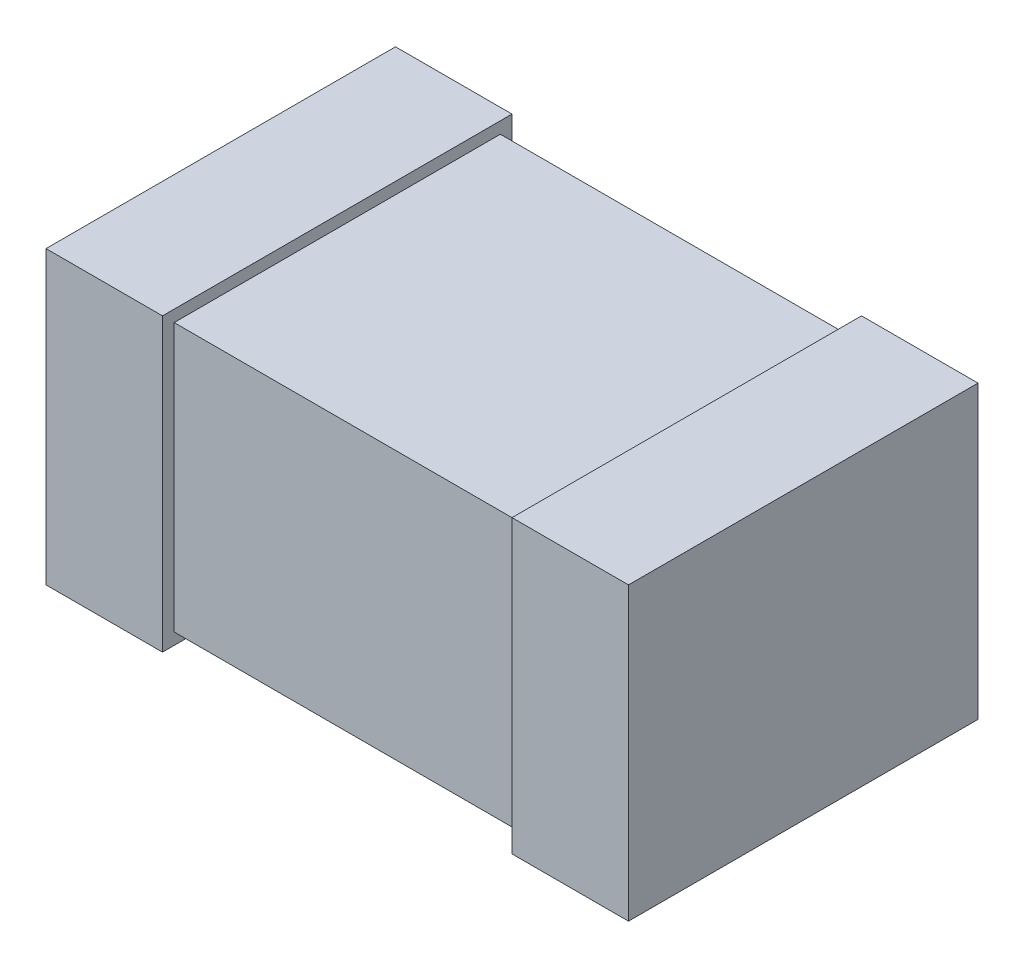
ISO-10303-21;
HEADER;
FILE_DESCRIPTION(('STEP AP214'),'2;1');
FILE_NAME('part.step','',(''),(''),'','','');
FILE_SCHEMA(('AUTOMOTIVE_DESIGN { 1 0 10303 214 1 1 1 1 }'));
ENDSEC;
DATA;
#1=APPLICATION_CONTEXT('core data for automotive mechanical design processes');
#2=APPLICATION_PROTOCOL_DEFINITION('international standard','automotive_design',2000,#1);
#3=PRODUCT_CONTEXT('',#1,'mechanical');
#4=PRODUCT('Part','Part','',(#3));
#5=PRODUCT_RELATED_PRODUCT_CATEGORY('part','',(#4));
#6=PRODUCT_DEFINITION_FORMATION('','',#4);
#7=PRODUCT_DEFINITION_CONTEXT('part definition',#1,'design');
#8=PRODUCT_DEFINITION('design','',#6,#7);
#9=PRODUCT_DEFINITION_SHAPE('','',#8);
#10=(LENGTH_UNIT() NAMED_UNIT(*) SI_UNIT(.MILLI.,.METRE.));
#11=(NAMED_UNIT(*) PLANE_ANGLE_UNIT() SI_UNIT($,.RADIAN.));
#12=(NAMED_UNIT(*) SI_UNIT($,.STERADIAN.) SOLID_ANGLE_UNIT());
#13=UNCERTAINTY_MEASURE_WITH_UNIT(LENGTH_MEASURE(1.E-05),#10,'distance_accuracy_value','');
#14=(GEOMETRIC_REPRESENTATION_CONTEXT(3) GLOBAL_UNCERTAINTY_ASSIGNED_CONTEXT((#13)) GLOBAL_UNIT_ASSIGNED_CONTEXT((#10,
#11,#12)) REPRESENTATION_CONTEXT('',''));
#15=CARTESIAN_POINT('',(0.,0.,0.));
#16=DIRECTION('',(0.,0.,1.));
#17=DIRECTION('',(1.,0.,0.));
#18=AXIS2_PLACEMENT_3D('',#15,#16,#17);
#19=CARTESIAN_POINT('',(0.5,-0.25,0.0762));
#20=DIRECTION('',(1.,0.,0.));
#21=DIRECTION('',(0.,1.,0.));
#22=AXIS2_PLACEMENT_3D('',#19,#20,#21);
#23=PLANE('',#22);
#24=DIRECTION('',(0.,0.,1.));
#25=VECTOR('',#24,1.);
#26=CARTESIAN_POINT('',(0.5,0.25,0.0762));
#27=LINE('',#26,#25);
#28=CARTESIAN_POINT('',(0.5,0.25,0.0762));
#29=VERTEX_POINT('',#28);
#30=CARTESIAN_POINT('',(0.5,0.25,0.6762));
#31=VERTEX_POINT('',#30);
#32=EDGE_CURVE('E174',#29,#31,#27,.T.);
#33=ORIENTED_EDGE('',*,*,#32,.T.);
#34=DIRECTION('',(0.,1.,0.));
#35=VECTOR('',#34,1.);
#36=CARTESIAN_POINT('',(0.5,-0.25,0.6762));
#37=LINE('',#36,#35);
#38=CARTESIAN_POINT('',(0.5,-0.25,0.6762));
#39=VERTEX_POINT('',#38);
#40=EDGE_CURVE('E157',#39,#31,#37,.T.);
#41=ORIENTED_EDGE('',*,*,#40,.F.);
#42=DIRECTION('',(0.,0.,1.));
#43=VECTOR('',#42,1.);
#44=CARTESIAN_POINT('',(0.5,-0.25,0.0762));
#45=LINE('',#44,#43);
#46=CARTESIAN_POINT('',(0.5,-0.25,0.0762));
#47=VERTEX_POINT('',#46);
#48=EDGE_CURVE('E154',#47,#39,#45,.T.);
#49=ORIENTED_EDGE('',*,*,#48,.F.);
#50=DIRECTION('',(0.,1.,0.));
#51=VECTOR('',#50,1.);
#52=CARTESIAN_POINT('',(0.5,-0.25,0.0762));
#53=LINE('',#52,#51);
#54=EDGE_CURVE('E143',#47,#29,#53,.T.);
#55=ORIENTED_EDGE('',*,*,#54,.T.);
#56=EDGE_LOOP('',(#33,#41,#49,#55));
#57=FACE_BOUND('',#56,.T.);
#58=ADVANCED_FACE('F17',(#57),#23,.T.);
#59=CARTESIAN_POINT('',(0.3,-0.23,0.0762));
#60=DIRECTION('',(0.,1.,0.));
#61=DIRECTION('',(1.,0.,0.));
#62=AXIS2_PLACEMENT_3D('',#59,#60,#61);
#63=PLANE('',#62);
#64=DIRECTION('',(0.,0.,-1.));
#65=VECTOR('',#64,1.);
#66=CARTESIAN_POINT('',(-0.3,-0.23,0.6562));
#67=LINE('',#66,#65);
#68=CARTESIAN_POINT('',(-0.3,-0.23,0.6562));
#69=VERTEX_POINT('',#68);
#70=CARTESIAN_POINT('',(-0.3,-0.23,0.0962));
#71=VERTEX_POINT('',#70);
#72=EDGE_CURVE('E235',#69,#71,#67,.T.);
#73=ORIENTED_EDGE('',*,*,#72,.T.);
#74=DIRECTION('',(-1.,0.,0.));
#75=VECTOR('',#74,1.);
#76=CARTESIAN_POINT('',(0.3,-0.23,0.0962));
#77=LINE('',#76,#75);
#78=CARTESIAN_POINT('',(0.3,-0.23,0.0962));
#79=VERTEX_POINT('',#78);
#80=EDGE_CURVE('E21',#79,#71,#77,.T.);
#81=ORIENTED_EDGE('',*,*,#80,.F.);
#82=DIRECTION('',(0.,0.,-1.));
#83=VECTOR('',#82,1.);
#84=CARTESIAN_POINT('',(0.3,-0.23,0.6562));
#85=LINE('',#84,#83);
#86=CARTESIAN_POINT('',(0.3,-0.23,0.6562));
#87=VERTEX_POINT('',#86);
#88=EDGE_CURVE('E166',#87,#79,#85,.T.);
#89=ORIENTED_EDGE('',*,*,#88,.F.);
#90=DIRECTION('',(-1.,0.,0.));
#91=VECTOR('',#90,1.);
#92=CARTESIAN_POINT('',(0.3,-0.23,0.6562));
#93=LINE('',#92,#91);
#94=EDGE_CURVE('E11',#87,#69,#93,.T.);
#95=ORIENTED_EDGE('',*,*,#94,.T.);
#96=EDGE_LOOP('',(#73,#81,#89,#95));
#97=FACE_BOUND('',#96,.T.);
#98=ADVANCED_FACE('F302',(#97),#63,.F.);
#99=CARTESIAN_POINT('',(0.3,0.25,0.6562));
#100=DIRECTION('',(0.,0.,-1.));
#101=DIRECTION('',(0.,-1.,0.));
#102=AXIS2_PLACEMENT_3D('',#99,#100,#101);
#103=PLANE('',#102);
#104=DIRECTION('',(0.,-1.,0.));
#105=VECTOR('',#104,1.);
#106=CARTESIAN_POINT('',(-0.3,0.23,0.6562));
#107=LINE('',#106,#105);
#108=CARTESIAN_POINT('',(-0.3,0.23,0.6562));
#109=VERTEX_POINT('',#108);
#110=EDGE_CURVE('E225',#109,#69,#107,.T.);
#111=ORIENTED_EDGE('',*,*,#110,.T.);
#112=ORIENTED_EDGE('',*,*,#94,.F.);
#113=DIRECTION('',(0.,-1.,0.));
#114=VECTOR('',#113,1.);
#115=CARTESIAN_POINT('',(0.3,0.23,0.6562));
#116=LINE('',#115,#114);
#117=CARTESIAN_POINT('',(0.3,0.23,0.6562));
#118=VERTEX_POINT('',#117);
#119=EDGE_CURVE('E171',#118,#87,#116,.T.);
#120=ORIENTED_EDGE('',*,*,#119,.F.);
#121=DIRECTION('',(1.,0.,0.));
#122=VECTOR('',#121,1.);
#123=CARTESIAN_POINT('',(-0.3,0.23,0.6562));
#124=LINE('',#123,#122);
#125=EDGE_CURVE('E28',#109,#118,#124,.T.);
#126=ORIENTED_EDGE('',*,*,#125,.F.);
#127=EDGE_LOOP('',(#111,#112,#120,#126));
#128=FACE_BOUND('',#127,.T.);
#129=ADVANCED_FACE('F308',(#128),#103,.F.);
#130=CARTESIAN_POINT('',(-0.3,0.23,0.0762));
#131=DIRECTION('',(0.,-1.,0.));
#132=DIRECTION('',(0.,0.,-1.));
#133=AXIS2_PLACEMENT_3D('',#130,#131,#132);
#134=PLANE('',#133);
#135=DIRECTION('',(0.,0.,-1.));
#136=VECTOR('',#135,1.);
#137=CARTESIAN_POINT('',(0.3,0.23,0.6562));
#138=LINE('',#137,#136);
#139=CARTESIAN_POINT('',(0.3,0.23,0.0962));
#140=VERTEX_POINT('',#139);
#141=EDGE_CURVE('E201',#118,#140,#138,.T.);
#142=ORIENTED_EDGE('',*,*,#141,.T.);
#143=DIRECTION('',(1.,0.,0.));
#144=VECTOR('',#143,1.);
#145=CARTESIAN_POINT('',(-0.3,0.23,0.0962));
#146=LINE('',#145,#144);
#147=CARTESIAN_POINT('',(-0.3,0.23,0.0962));
#148=VERTEX_POINT('',#147);
#149=EDGE_CURVE('E257',#148,#140,#146,.T.);
#150=ORIENTED_EDGE('',*,*,#149,.F.);
#151=DIRECTION('',(0.,0.,-1.));
#152=VECTOR('',#151,1.);
#153=CARTESIAN_POINT('',(-0.3,0.23,0.6562));
#154=LINE('',#153,#152);
#155=EDGE_CURVE('E270',#109,#148,#154,.T.);
#156=ORIENTED_EDGE('',*,*,#155,.F.);
#157=ORIENTED_EDGE('',*,*,#125,.T.);
#158=EDGE_LOOP('',(#142,#150,#156,#157));
#159=FACE_BOUND('',#158,.T.);
#160=ADVANCED_FACE('F326',(#159),#134,.F.);
#161=CARTESIAN_POINT('',(-0.3,0.25,0.0962));
#162=DIRECTION('',(0.,0.,1.));
#163=DIRECTION('',(1.,0.,0.));
#164=AXIS2_PLACEMENT_3D('',#161,#162,#163);
#165=PLANE('',#164);
#166=DIRECTION('',(0.,-1.,0.));
#167=VECTOR('',#166,1.);
#168=CARTESIAN_POINT('',(0.3,0.23,0.0962));
#169=LINE('',#168,#167);
#170=EDGE_CURVE('E170',#140,#79,#169,.T.);
#171=ORIENTED_EDGE('',*,*,#170,.T.);
#172=ORIENTED_EDGE('',*,*,#80,.T.);
#173=DIRECTION('',(0.,-1.,0.));
#174=VECTOR('',#173,1.);
#175=CARTESIAN_POINT('',(-0.3,0.23,0.0962));
#176=LINE('',#175,#174);
#177=EDGE_CURVE('E267',#148,#71,#176,.T.);
#178=ORIENTED_EDGE('',*,*,#177,.F.);
#179=ORIENTED_EDGE('',*,*,#149,.T.);
#180=EDGE_LOOP('',(#171,#172,#178,#179));
#181=FACE_BOUND('',#180,.T.);
#182=ADVANCED_FACE('F329',(#181),#165,.F.);
#183=CARTESIAN_POINT('',(0.3,0.23,0.0762));
#184=DIRECTION('',(1.,0.,0.));
#185=DIRECTION('',(0.,1.,0.));
#186=AXIS2_PLACEMENT_3D('',#183,#184,#185);
#187=PLANE('',#186);
#188=ORIENTED_EDGE('',*,*,#141,.F.);
#189=ORIENTED_EDGE('',*,*,#119,.T.);
#190=ORIENTED_EDGE('',*,*,#88,.T.);
#191=ORIENTED_EDGE('',*,*,#170,.F.);
#192=EDGE_LOOP('',(#188,#189,#190,#191));
#193=FACE_BOUND('',#192,.T.);
#194=DIRECTION('',(0.,0.,1.));
#195=VECTOR('',#194,1.);
#196=CARTESIAN_POINT('',(0.3,0.25,0.0762));
#197=LINE('',#196,#195);
#198=CARTESIAN_POINT('',(0.3,0.25,0.0762));
#199=VERTEX_POINT('',#198);
#200=CARTESIAN_POINT('',(0.3,0.25,0.6762));
#201=VERTEX_POINT('',#200);
#202=EDGE_CURVE('E134',#199,#201,#197,.T.);
#203=ORIENTED_EDGE('',*,*,#202,.F.);
#204=DIRECTION('',(0.,1.,0.));
#205=VECTOR('',#204,1.);
#206=CARTESIAN_POINT('',(0.3,-0.25,0.0762));
#207=LINE('',#206,#205);
#208=CARTESIAN_POINT('',(0.3,-0.25,0.0762));
#209=VERTEX_POINT('',#208);
#210=EDGE_CURVE('E131',#209,#199,#207,.T.);
#211=ORIENTED_EDGE('',*,*,#210,.F.);
#212=DIRECTION('',(0.,0.,1.));
#213=VECTOR('',#212,1.);
#214=CARTESIAN_POINT('',(0.3,-0.25,0.0762));
#215=LINE('',#214,#213);
#216=CARTESIAN_POINT('',(0.3,-0.25,0.6762));
#217=VERTEX_POINT('',#216);
#218=EDGE_CURVE('E117',#209,#217,#215,.T.);
#219=ORIENTED_EDGE('',*,*,#218,.T.);
#220=DIRECTION('',(0.,-1.,0.));
#221=VECTOR('',#220,1.);
#222=CARTESIAN_POINT('',(0.3,0.25,0.6762));
#223=LINE('',#222,#221);
#224=EDGE_CURVE('E159',#201,#217,#223,.T.);
#225=ORIENTED_EDGE('',*,*,#224,.F.);
#226=EDGE_LOOP('',(#203,#211,#219,#225));
#227=FACE_BOUND('',#226,.T.);
#228=ADVANCED_FACE('F132',(#193,#227),#187,.F.);
#229=CARTESIAN_POINT('',(0.,0.,0.6762));
#230=DIRECTION('',(0.,0.,1.));
#231=DIRECTION('',(1.,0.,0.));
#232=AXIS2_PLACEMENT_3D('',#229,#230,#231);
#233=PLANE('',#232);
#234=DIRECTION('',(-1.,0.,0.));
#235=VECTOR('',#234,1.);
#236=CARTESIAN_POINT('',(-0.3,0.25,0.6762));
#237=LINE('',#236,#235);
#238=CARTESIAN_POINT('',(-0.3,0.25,0.6762));
#239=VERTEX_POINT('',#238);
#240=CARTESIAN_POINT('',(-0.5,0.25,0.6762));
#241=VERTEX_POINT('',#240);
#242=EDGE_CURVE('E108',#239,#241,#237,.T.);
#243=ORIENTED_EDGE('',*,*,#242,.T.);
#244=DIRECTION('',(0.,-1.,0.));
#245=VECTOR('',#244,1.);
#246=CARTESIAN_POINT('',(-0.5,0.25,0.6762));
#247=LINE('',#246,#245);
#248=CARTESIAN_POINT('',(-0.5,-0.25,0.6762));
#249=VERTEX_POINT('',#248);
#250=EDGE_CURVE('E127',#241,#249,#247,.T.);
#251=ORIENTED_EDGE('',*,*,#250,.T.);
#252=DIRECTION('',(1.,0.,0.));
#253=VECTOR('',#252,1.);
#254=CARTESIAN_POINT('',(-0.5,-0.25,0.6762));
#255=LINE('',#254,#253);
#256=CARTESIAN_POINT('',(-0.3,-0.25,0.6762));
#257=VERTEX_POINT('',#256);
#258=EDGE_CURVE('E218',#249,#257,#255,.T.);
#259=ORIENTED_EDGE('',*,*,#258,.T.);
#260=DIRECTION('',(0.,1.,0.));
#261=VECTOR('',#260,1.);
#262=CARTESIAN_POINT('',(-0.3,-0.25,0.6762));
#263=LINE('',#262,#261);
#264=EDGE_CURVE('E193',#257,#239,#263,.T.);
#265=ORIENTED_EDGE('',*,*,#264,.T.);
#266=EDGE_LOOP('',(#243,#251,#259,#265));
#267=FACE_BOUND('',#266,.T.);
#268=ADVANCED_FACE('F283',(#267),#233,.T.);
#269=CARTESIAN_POINT('',(0.,0.,0.6762));
#270=DIRECTION('',(0.,0.,1.));
#271=DIRECTION('',(1.,0.,0.));
#272=AXIS2_PLACEMENT_3D('',#269,#270,#271);
#273=PLANE('',#272);
#274=DIRECTION('',(1.,0.,0.));
#275=VECTOR('',#274,1.);
#276=CARTESIAN_POINT('',(0.3,-0.25,0.6762));
#277=LINE('',#276,#275);
#278=EDGE_CURVE('E124',#217,#39,#277,.T.);
#279=ORIENTED_EDGE('',*,*,#278,.T.);
#280=ORIENTED_EDGE('',*,*,#40,.T.);
#281=DIRECTION('',(-1.,0.,0.));
#282=VECTOR('',#281,1.);
#283=CARTESIAN_POINT('',(0.5,0.25,0.6762));
#284=LINE('',#283,#282);
#285=EDGE_CURVE('E183',#31,#201,#284,.T.);
#286=ORIENTED_EDGE('',*,*,#285,.T.);
#287=ORIENTED_EDGE('',*,*,#224,.T.);
#288=EDGE_LOOP('',(#279,#280,#286,#287));
#289=FACE_BOUND('',#288,.T.);
#290=ADVANCED_FACE('F333',(#289),#273,.T.);
#291=CARTESIAN_POINT('',(0.5,0.25,0.0762));
#292=DIRECTION('',(0.,1.,0.));
#293=DIRECTION('',(1.,0.,0.));
#294=AXIS2_PLACEMENT_3D('',#291,#292,#293);
#295=PLANE('',#294);
#296=ORIENTED_EDGE('',*,*,#285,.F.);
#297=ORIENTED_EDGE('',*,*,#32,.F.);
#298=DIRECTION('',(-1.,0.,0.));
#299=VECTOR('',#298,1.);
#300=CARTESIAN_POINT('',(0.5,0.25,0.0762));
#301=LINE('',#300,#299);
#302=EDGE_CURVE('E151',#29,#199,#301,.T.);
#303=ORIENTED_EDGE('',*,*,#302,.T.);
#304=ORIENTED_EDGE('',*,*,#202,.T.);
#305=EDGE_LOOP('',(#296,#297,#303,#304));
#306=FACE_BOUND('',#305,.T.);
#307=ADVANCED_FACE('F297',(#306),#295,.T.);
#308=CARTESIAN_POINT('',(0.5,0.25,0.0762));
#309=DIRECTION('',(0.,1.,0.));
#310=DIRECTION('',(1.,0.,0.));
#311=AXIS2_PLACEMENT_3D('',#308,#309,#310);
#312=PLANE('',#311);
#313=DIRECTION('',(-1.,0.,0.));
#314=VECTOR('',#313,1.);
#315=CARTESIAN_POINT('',(-0.3,0.25,0.0762));
#316=LINE('',#315,#314);
#317=CARTESIAN_POINT('',(-0.3,0.25,0.0762));
#318=VERTEX_POINT('',#317);
#319=CARTESIAN_POINT('',(-0.5,0.25,0.0762));
#320=VERTEX_POINT('',#319);
#321=EDGE_CURVE('E211',#318,#320,#316,.T.);
#322=ORIENTED_EDGE('',*,*,#321,.T.);
#323=DIRECTION('',(0.,0.,1.));
#324=VECTOR('',#323,1.);
#325=CARTESIAN_POINT('',(-0.5,0.25,0.0762));
#326=LINE('',#325,#324);
#327=EDGE_CURVE('E198',#320,#241,#326,.T.);
#328=ORIENTED_EDGE('',*,*,#327,.T.);
#329=ORIENTED_EDGE('',*,*,#242,.F.);
#330=DIRECTION('',(0.,0.,1.));
#331=VECTOR('',#330,1.);
#332=CARTESIAN_POINT('',(-0.3,0.25,0.0762));
#333=LINE('',#332,#331);
#334=EDGE_CURVE('E139',#318,#239,#333,.T.);
#335=ORIENTED_EDGE('',*,*,#334,.F.);
#336=EDGE_LOOP('',(#322,#328,#329,#335));
#337=FACE_BOUND('',#336,.T.);
#338=ADVANCED_FACE('F285',(#337),#312,.T.);
#339=CARTESIAN_POINT('',(-0.5,0.25,0.0762));
#340=DIRECTION('',(-1.,0.,0.));
#341=DIRECTION('',(0.,0.,1.));
#342=AXIS2_PLACEMENT_3D('',#339,#340,#341);
#343=PLANE('',#342);
#344=DIRECTION('',(0.,0.,1.));
#345=VECTOR('',#344,1.);
#346=CARTESIAN_POINT('',(-0.5,-0.25,0.0762));
#347=LINE('',#346,#345);
#348=CARTESIAN_POINT('',(-0.5,-0.25,0.0762));
#349=VERTEX_POINT('',#348);
#350=EDGE_CURVE('E215',#349,#249,#347,.T.);
#351=ORIENTED_EDGE('',*,*,#350,.T.);
#352=ORIENTED_EDGE('',*,*,#250,.F.);
#353=ORIENTED_EDGE('',*,*,#327,.F.);
#354=DIRECTION('',(0.,-1.,0.));
#355=VECTOR('',#354,1.);
#356=CARTESIAN_POINT('',(-0.5,0.25,0.0762));
#357=LINE('',#356,#355);
#358=EDGE_CURVE('E165',#320,#349,#357,.T.);
#359=ORIENTED_EDGE('',*,*,#358,.T.);
#360=EDGE_LOOP('',(#351,#352,#353,#359));
#361=FACE_BOUND('',#360,.T.);
#362=ADVANCED_FACE('F288',(#361),#343,.T.);
#363=CARTESIAN_POINT('',(-0.5,-0.25,0.0762));
#364=DIRECTION('',(0.,-1.,0.));
#365=DIRECTION('',(0.,0.,-1.));
#366=AXIS2_PLACEMENT_3D('',#363,#364,#365);
#367=PLANE('',#366);
#368=DIRECTION('',(1.,0.,0.));
#369=VECTOR('',#368,1.);
#370=CARTESIAN_POINT('',(0.3,-0.25,0.0762));
#371=LINE('',#370,#369);
#372=EDGE_CURVE('E121',#209,#47,#371,.T.);
#373=ORIENTED_EDGE('',*,*,#372,.T.);
#374=ORIENTED_EDGE('',*,*,#48,.T.);
#375=ORIENTED_EDGE('',*,*,#278,.F.);
#376=ORIENTED_EDGE('',*,*,#218,.F.);
#377=EDGE_LOOP('',(#373,#374,#375,#376));
#378=FACE_BOUND('',#377,.T.);
#379=ADVANCED_FACE('F19',(#378),#367,.T.);
#380=CARTESIAN_POINT('',(-0.5,-0.25,0.0762));
#381=DIRECTION('',(0.,-1.,0.));
#382=DIRECTION('',(0.,0.,-1.));
#383=AXIS2_PLACEMENT_3D('',#380,#381,#382);
#384=PLANE('',#383);
#385=ORIENTED_EDGE('',*,*,#258,.F.);
#386=ORIENTED_EDGE('',*,*,#350,.F.);
#387=DIRECTION('',(1.,0.,0.));
#388=VECTOR('',#387,1.);
#389=CARTESIAN_POINT('',(-0.5,-0.25,0.0762));
#390=LINE('',#389,#388);
#391=CARTESIAN_POINT('',(-0.3,-0.25,0.0762));
#392=VERTEX_POINT('',#391);
#393=EDGE_CURVE('E161',#349,#392,#390,.T.);
#394=ORIENTED_EDGE('',*,*,#393,.T.);
#395=DIRECTION('',(0.,0.,1.));
#396=VECTOR('',#395,1.);
#397=CARTESIAN_POINT('',(-0.3,-0.25,0.0762));
#398=LINE('',#397,#396);
#399=EDGE_CURVE('E195',#392,#257,#398,.T.);
#400=ORIENTED_EDGE('',*,*,#399,.T.);
#401=EDGE_LOOP('',(#385,#386,#394,#400));
#402=FACE_BOUND('',#401,.T.);
#403=ADVANCED_FACE('F280',(#402),#384,.T.);
#404=CARTESIAN_POINT('',(-0.3,0.25,0.0762));
#405=DIRECTION('',(-1.,0.,0.));
#406=DIRECTION('',(0.,0.,1.));
#407=AXIS2_PLACEMENT_3D('',#404,#405,#406);
#408=PLANE('',#407);
#409=ORIENTED_EDGE('',*,*,#155,.T.);
#410=ORIENTED_EDGE('',*,*,#177,.T.);
#411=ORIENTED_EDGE('',*,*,#72,.F.);
#412=ORIENTED_EDGE('',*,*,#110,.F.);
#413=EDGE_LOOP('',(#409,#410,#411,#412));
#414=FACE_BOUND('',#413,.T.);
#415=ORIENTED_EDGE('',*,*,#334,.T.);
#416=ORIENTED_EDGE('',*,*,#264,.F.);
#417=ORIENTED_EDGE('',*,*,#399,.F.);
#418=DIRECTION('',(0.,-1.,0.));
#419=VECTOR('',#418,1.);
#420=CARTESIAN_POINT('',(-0.3,0.25,0.0762));
#421=LINE('',#420,#419);
#422=EDGE_CURVE('E214',#318,#392,#421,.T.);
#423=ORIENTED_EDGE('',*,*,#422,.F.);
#424=EDGE_LOOP('',(#415,#416,#417,#423));
#425=FACE_BOUND('',#424,.T.);
#426=ADVANCED_FACE('F282',(#414,#425),#408,.F.);
#427=CARTESIAN_POINT('',(0.,0.,0.0762));
#428=DIRECTION('',(0.,0.,1.));
#429=DIRECTION('',(1.,0.,0.));
#430=AXIS2_PLACEMENT_3D('',#427,#428,#429);
#431=PLANE('',#430);
#432=ORIENTED_EDGE('',*,*,#302,.F.);
#433=ORIENTED_EDGE('',*,*,#54,.F.);
#434=ORIENTED_EDGE('',*,*,#372,.F.);
#435=ORIENTED_EDGE('',*,*,#210,.T.);
#436=EDGE_LOOP('',(#432,#433,#434,#435));
#437=FACE_BOUND('',#436,.T.);
#438=ADVANCED_FACE('F141',(#437),#431,.F.);
#439=CARTESIAN_POINT('',(0.,0.,0.0762));
#440=DIRECTION('',(0.,0.,1.));
#441=DIRECTION('',(1.,0.,0.));
#442=AXIS2_PLACEMENT_3D('',#439,#440,#441);
#443=PLANE('',#442);
#444=ORIENTED_EDGE('',*,*,#393,.F.);
#445=ORIENTED_EDGE('',*,*,#358,.F.);
#446=ORIENTED_EDGE('',*,*,#321,.F.);
#447=ORIENTED_EDGE('',*,*,#422,.T.);
#448=EDGE_LOOP('',(#444,#445,#446,#447));
#449=FACE_BOUND('',#448,.T.);
#450=ADVANCED_FACE('F323',(#449),#443,.F.);
#451=CLOSED_SHELL('',(#58,#98,#129,#160,#182,#228,#268,#290,#307,#338,#362,#379,#403,#426,#438,#450));
#452=MANIFOLD_SOLID_BREP('B1',#451);
#453=ADVANCED_BREP_SHAPE_REPRESENTATION('',(#18,#452),#14);
#454=SHAPE_DEFINITION_REPRESENTATION(#9,#453);
ENDSEC;
END-ISO-10303-21;
